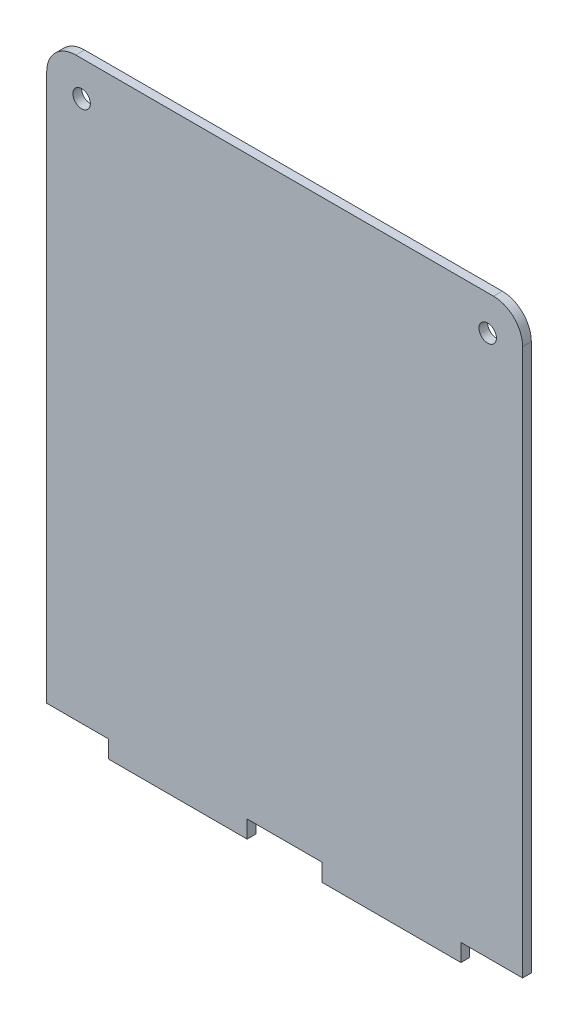
ISO-10303-21;
HEADER;
FILE_DESCRIPTION(('STEP AP214'),'2;1');
FILE_NAME('part.step','',(''),(''),'','','');
FILE_SCHEMA(('AUTOMOTIVE_DESIGN { 1 0 10303 214 1 1 1 1 }'));
ENDSEC;
DATA;
#1=APPLICATION_CONTEXT('core data for automotive mechanical design processes');
#2=APPLICATION_PROTOCOL_DEFINITION('international standard','automotive_design',2000,#1);
#3=PRODUCT_CONTEXT('',#1,'mechanical');
#4=PRODUCT('Part','Part','',(#3));
#5=PRODUCT_RELATED_PRODUCT_CATEGORY('part','',(#4));
#6=PRODUCT_DEFINITION_FORMATION('','',#4);
#7=PRODUCT_DEFINITION_CONTEXT('part definition',#1,'design');
#8=PRODUCT_DEFINITION('design','',#6,#7);
#9=PRODUCT_DEFINITION_SHAPE('','',#8);
#10=(LENGTH_UNIT() NAMED_UNIT(*) SI_UNIT(.MILLI.,.METRE.));
#11=(NAMED_UNIT(*) PLANE_ANGLE_UNIT() SI_UNIT($,.RADIAN.));
#12=(NAMED_UNIT(*) SI_UNIT($,.STERADIAN.) SOLID_ANGLE_UNIT());
#13=UNCERTAINTY_MEASURE_WITH_UNIT(LENGTH_MEASURE(1.E-05),#10,'distance_accuracy_value','');
#14=(GEOMETRIC_REPRESENTATION_CONTEXT(3) GLOBAL_UNCERTAINTY_ASSIGNED_CONTEXT((#13)) GLOBAL_UNIT_ASSIGNED_CONTEXT((#10,
#11,#12)) REPRESENTATION_CONTEXT('',''));
#15=CARTESIAN_POINT('',(0.,0.,0.));
#16=DIRECTION('',(0.,0.,1.));
#17=DIRECTION('',(1.,0.,0.));
#18=AXIS2_PLACEMENT_3D('',#15,#16,#17);
#19=CARTESIAN_POINT('',(0.,0.,1.5));
#20=DIRECTION('',(0.,0.,-1.));
#21=DIRECTION('',(-1.,0.,0.));
#22=AXIS2_PLACEMENT_3D('',#19,#20,#21);
#23=PLANE('',#22);
#24=CARTESIAN_POINT('',(75.8,96.,1.5));
#25=DIRECTION('',(0.,0.,-1.));
#26=DIRECTION('',(-1.,0.,0.));
#27=AXIS2_PLACEMENT_3D('',#24,#25,#26);
#28=CIRCLE('',#27,1.5);
#29=CARTESIAN_POINT('',(74.3,96.,1.5));
#30=VERTEX_POINT('',#29);
#31=EDGE_CURVE('E332',#30,#30,#28,.T.);
#32=ORIENTED_EDGE('',*,*,#31,.T.);
#33=EDGE_LOOP('',(#32));
#34=FACE_BOUND('',#33,.T.);
#35=CARTESIAN_POINT('',(6.,96.,1.5));
#36=DIRECTION('',(0.,0.,1.));
#37=DIRECTION('',(1.,0.,0.));
#38=AXIS2_PLACEMENT_3D('',#35,#36,#37);
#39=CIRCLE('',#38,1.5);
#40=CARTESIAN_POINT('',(7.5,96.,1.5));
#41=VERTEX_POINT('',#40);
#42=EDGE_CURVE('E159',#41,#41,#39,.T.);
#43=ORIENTED_EDGE('',*,*,#42,.F.);
#44=EDGE_LOOP('',(#43));
#45=FACE_BOUND('',#44,.T.);
#46=DIRECTION('',(0.,1.,0.));
#47=VECTOR('',#46,1.);
#48=CARTESIAN_POINT('',(81.8,0.,1.5));
#49=LINE('',#48,#47);
#50=CARTESIAN_POINT('',(81.8,3.,1.5));
#51=VERTEX_POINT('',#50);
#52=CARTESIAN_POINT('',(81.8,97.,1.5));
#53=VERTEX_POINT('',#52);
#54=EDGE_CURVE('E169',#51,#53,#49,.T.);
#55=ORIENTED_EDGE('',*,*,#54,.T.);
#56=CARTESIAN_POINT('',(76.8,97.,1.5));
#57=DIRECTION('',(0.,0.,-1.));
#58=DIRECTION('',(-1.,0.,0.));
#59=AXIS2_PLACEMENT_3D('',#56,#57,#58);
#60=CIRCLE('',#59,5.);
#61=CARTESIAN_POINT('',(76.8,102.,1.5));
#62=VERTEX_POINT('',#61);
#63=EDGE_CURVE('E43',#53,#62,#60,.F.);
#64=ORIENTED_EDGE('',*,*,#63,.T.);
#65=DIRECTION('',(-1.,0.,0.));
#66=VECTOR('',#65,1.);
#67=CARTESIAN_POINT('',(0.,102.,1.5));
#68=LINE('',#67,#66);
#69=CARTESIAN_POINT('',(5.,102.,1.5));
#70=VERTEX_POINT('',#69);
#71=EDGE_CURVE('E175',#62,#70,#68,.T.);
#72=ORIENTED_EDGE('',*,*,#71,.T.);
#73=CARTESIAN_POINT('',(5.,97.,1.5));
#74=DIRECTION('',(0.,0.,-1.));
#75=DIRECTION('',(-1.,0.,0.));
#76=AXIS2_PLACEMENT_3D('',#73,#74,#75);
#77=CIRCLE('',#76,5.);
#78=CARTESIAN_POINT('',(0.,97.,1.5));
#79=VERTEX_POINT('',#78);
#80=EDGE_CURVE('E50',#70,#79,#77,.F.);
#81=ORIENTED_EDGE('',*,*,#80,.T.);
#82=DIRECTION('',(0.,-1.,0.));
#83=VECTOR('',#82,1.);
#84=CARTESIAN_POINT('',(0.,0.,1.5));
#85=LINE('',#84,#83);
#86=CARTESIAN_POINT('',(0.,3.,1.5));
#87=VERTEX_POINT('',#86);
#88=EDGE_CURVE('E166',#79,#87,#85,.T.);
#89=ORIENTED_EDGE('',*,*,#88,.T.);
#90=DIRECTION('',(1.,0.,0.));
#91=VECTOR('',#90,1.);
#92=CARTESIAN_POINT('',(0.,3.,1.5));
#93=LINE('',#92,#91);
#94=CARTESIAN_POINT('',(10.6,3.,1.5));
#95=VERTEX_POINT('',#94);
#96=EDGE_CURVE('E251',#87,#95,#93,.T.);
#97=ORIENTED_EDGE('',*,*,#96,.T.);
#98=DIRECTION('',(0.,1.,0.));
#99=VECTOR('',#98,1.);
#100=CARTESIAN_POINT('',(10.6,0.,1.5));
#101=LINE('',#100,#99);
#102=CARTESIAN_POINT('',(10.6,0.,1.5));
#103=VERTEX_POINT('',#102);
#104=EDGE_CURVE('E241',#103,#95,#101,.T.);
#105=ORIENTED_EDGE('',*,*,#104,.F.);
#106=DIRECTION('',(1.,0.,0.));
#107=VECTOR('',#106,1.);
#108=CARTESIAN_POINT('',(0.,0.,1.5));
#109=LINE('',#108,#107);
#110=CARTESIAN_POINT('',(34.455,0.,1.5));
#111=VERTEX_POINT('',#110);
#112=EDGE_CURVE('E165',#103,#111,#109,.T.);
#113=ORIENTED_EDGE('',*,*,#112,.T.);
#114=DIRECTION('',(0.,1.,0.));
#115=VECTOR('',#114,1.);
#116=CARTESIAN_POINT('',(34.455,0.,1.5));
#117=LINE('',#116,#115);
#118=CARTESIAN_POINT('',(34.455,3.,1.5));
#119=VERTEX_POINT('',#118);
#120=EDGE_CURVE('E234',#111,#119,#117,.T.);
#121=ORIENTED_EDGE('',*,*,#120,.T.);
#122=DIRECTION('',(1.,0.,0.));
#123=VECTOR('',#122,1.);
#124=CARTESIAN_POINT('',(0.,3.,1.5));
#125=LINE('',#124,#123);
#126=CARTESIAN_POINT('',(47.345,3.,1.5));
#127=VERTEX_POINT('',#126);
#128=EDGE_CURVE('E237',#119,#127,#125,.T.);
#129=ORIENTED_EDGE('',*,*,#128,.T.);
#130=DIRECTION('',(0.,1.,0.));
#131=VECTOR('',#130,1.);
#132=CARTESIAN_POINT('',(47.345,0.,1.5));
#133=LINE('',#132,#131);
#134=CARTESIAN_POINT('',(47.345,0.,1.5));
#135=VERTEX_POINT('',#134);
#136=EDGE_CURVE('E164',#135,#127,#133,.T.);
#137=ORIENTED_EDGE('',*,*,#136,.F.);
#138=CARTESIAN_POINT('',(71.2,0.,1.5));
#139=VERTEX_POINT('',#138);
#140=EDGE_CURVE('E156',#135,#139,#109,.T.);
#141=ORIENTED_EDGE('',*,*,#140,.T.);
#142=DIRECTION('',(0.,1.,0.));
#143=VECTOR('',#142,1.);
#144=CARTESIAN_POINT('',(71.2,0.,1.5));
#145=LINE('',#144,#143);
#146=CARTESIAN_POINT('',(71.2,3.,1.5));
#147=VERTEX_POINT('',#146);
#148=EDGE_CURVE('E138',#139,#147,#145,.T.);
#149=ORIENTED_EDGE('',*,*,#148,.T.);
#150=DIRECTION('',(-1.,0.,0.));
#151=VECTOR('',#150,1.);
#152=CARTESIAN_POINT('',(0.,3.,1.5));
#153=LINE('',#152,#151);
#154=EDGE_CURVE('E148',#51,#147,#153,.T.);
#155=ORIENTED_EDGE('',*,*,#154,.F.);
#156=EDGE_LOOP('',(#55,#64,#72,#81,#89,#97,#105,#113,#121,#129,#137,#141,#149,#155));
#157=FACE_BOUND('',#156,.T.);
#158=ADVANCED_FACE('F35',(#34,#45,#157),#23,.F.);
#159=CARTESIAN_POINT('',(0.,0.,0.));
#160=DIRECTION('',(0.,0.,-1.));
#161=DIRECTION('',(-1.,0.,0.));
#162=AXIS2_PLACEMENT_3D('',#159,#160,#161);
#163=PLANE('',#162);
#164=CARTESIAN_POINT('',(75.8,96.,0.));
#165=DIRECTION('',(0.,0.,-1.));
#166=DIRECTION('',(-1.,0.,0.));
#167=AXIS2_PLACEMENT_3D('',#164,#165,#166);
#168=CIRCLE('',#167,1.5);
#169=CARTESIAN_POINT('',(74.3,96.,0.));
#170=VERTEX_POINT('',#169);
#171=EDGE_CURVE('E330',#170,#170,#168,.T.);
#172=ORIENTED_EDGE('',*,*,#171,.F.);
#173=EDGE_LOOP('',(#172));
#174=FACE_BOUND('',#173,.T.);
#175=CARTESIAN_POINT('',(6.,96.,0.));
#176=DIRECTION('',(0.,0.,1.));
#177=DIRECTION('',(1.,0.,0.));
#178=AXIS2_PLACEMENT_3D('',#175,#176,#177);
#179=CIRCLE('',#178,1.5);
#180=CARTESIAN_POINT('',(7.5,96.,0.));
#181=VERTEX_POINT('',#180);
#182=EDGE_CURVE('E219',#181,#181,#179,.T.);
#183=ORIENTED_EDGE('',*,*,#182,.T.);
#184=EDGE_LOOP('',(#183));
#185=FACE_BOUND('',#184,.T.);
#186=DIRECTION('',(-1.,0.,0.));
#187=VECTOR('',#186,1.);
#188=CARTESIAN_POINT('',(0.,102.,0.));
#189=LINE('',#188,#187);
#190=CARTESIAN_POINT('',(76.8,102.,0.));
#191=VERTEX_POINT('',#190);
#192=CARTESIAN_POINT('',(5.,102.,0.));
#193=VERTEX_POINT('',#192);
#194=EDGE_CURVE('E170',#191,#193,#189,.T.);
#195=ORIENTED_EDGE('',*,*,#194,.F.);
#196=CARTESIAN_POINT('',(76.8,97.,0.));
#197=DIRECTION('',(0.,0.,-1.));
#198=DIRECTION('',(-1.,0.,0.));
#199=AXIS2_PLACEMENT_3D('',#196,#197,#198);
#200=CIRCLE('',#199,5.);
#201=CARTESIAN_POINT('',(81.8,97.,0.));
#202=VERTEX_POINT('',#201);
#203=EDGE_CURVE('E194',#191,#202,#200,.T.);
#204=ORIENTED_EDGE('',*,*,#203,.T.);
#205=DIRECTION('',(0.,1.,0.));
#206=VECTOR('',#205,1.);
#207=CARTESIAN_POINT('',(81.8,0.,0.));
#208=LINE('',#207,#206);
#209=CARTESIAN_POINT('',(81.8,3.,0.));
#210=VERTEX_POINT('',#209);
#211=EDGE_CURVE('E184',#210,#202,#208,.T.);
#212=ORIENTED_EDGE('',*,*,#211,.F.);
#213=DIRECTION('',(-1.,0.,0.));
#214=VECTOR('',#213,1.);
#215=CARTESIAN_POINT('',(0.,3.,0.));
#216=LINE('',#215,#214);
#217=CARTESIAN_POINT('',(71.2,3.,0.));
#218=VERTEX_POINT('',#217);
#219=EDGE_CURVE('E149',#210,#218,#216,.T.);
#220=ORIENTED_EDGE('',*,*,#219,.T.);
#221=DIRECTION('',(0.,1.,0.));
#222=VECTOR('',#221,1.);
#223=CARTESIAN_POINT('',(71.2,0.,0.));
#224=LINE('',#223,#222);
#225=CARTESIAN_POINT('',(71.2,0.,0.));
#226=VERTEX_POINT('',#225);
#227=EDGE_CURVE('E214',#226,#218,#224,.T.);
#228=ORIENTED_EDGE('',*,*,#227,.F.);
#229=DIRECTION('',(1.,0.,0.));
#230=VECTOR('',#229,1.);
#231=CARTESIAN_POINT('',(0.,0.,0.));
#232=LINE('',#231,#230);
#233=CARTESIAN_POINT('',(47.345,0.,0.));
#234=VERTEX_POINT('',#233);
#235=EDGE_CURVE('E158',#234,#226,#232,.T.);
#236=ORIENTED_EDGE('',*,*,#235,.F.);
#237=DIRECTION('',(0.,1.,0.));
#238=VECTOR('',#237,1.);
#239=CARTESIAN_POINT('',(47.345,0.,0.));
#240=LINE('',#239,#238);
#241=CARTESIAN_POINT('',(47.345,3.,0.));
#242=VERTEX_POINT('',#241);
#243=EDGE_CURVE('E238',#234,#242,#240,.T.);
#244=ORIENTED_EDGE('',*,*,#243,.T.);
#245=DIRECTION('',(1.,0.,0.));
#246=VECTOR('',#245,1.);
#247=CARTESIAN_POINT('',(0.,3.,0.));
#248=LINE('',#247,#246);
#249=CARTESIAN_POINT('',(34.455,3.,0.));
#250=VERTEX_POINT('',#249);
#251=EDGE_CURVE('E243',#250,#242,#248,.T.);
#252=ORIENTED_EDGE('',*,*,#251,.F.);
#253=DIRECTION('',(0.,1.,0.));
#254=VECTOR('',#253,1.);
#255=CARTESIAN_POINT('',(34.455,0.,0.));
#256=LINE('',#255,#254);
#257=CARTESIAN_POINT('',(34.455,0.,0.));
#258=VERTEX_POINT('',#257);
#259=EDGE_CURVE('E227',#258,#250,#256,.T.);
#260=ORIENTED_EDGE('',*,*,#259,.F.);
#261=CARTESIAN_POINT('',(10.6,0.,0.));
#262=VERTEX_POINT('',#261);
#263=EDGE_CURVE('E181',#262,#258,#232,.T.);
#264=ORIENTED_EDGE('',*,*,#263,.F.);
#265=DIRECTION('',(0.,1.,0.));
#266=VECTOR('',#265,1.);
#267=CARTESIAN_POINT('',(10.6,0.,0.));
#268=LINE('',#267,#266);
#269=CARTESIAN_POINT('',(10.6,3.,0.));
#270=VERTEX_POINT('',#269);
#271=EDGE_CURVE('E247',#262,#270,#268,.T.);
#272=ORIENTED_EDGE('',*,*,#271,.T.);
#273=DIRECTION('',(1.,0.,0.));
#274=VECTOR('',#273,1.);
#275=CARTESIAN_POINT('',(0.,3.,0.));
#276=LINE('',#275,#274);
#277=CARTESIAN_POINT('',(0.,3.,0.));
#278=VERTEX_POINT('',#277);
#279=EDGE_CURVE('E250',#278,#270,#276,.T.);
#280=ORIENTED_EDGE('',*,*,#279,.F.);
#281=DIRECTION('',(0.,-1.,0.));
#282=VECTOR('',#281,1.);
#283=CARTESIAN_POINT('',(0.,0.,0.));
#284=LINE('',#283,#282);
#285=CARTESIAN_POINT('',(0.,97.,0.));
#286=VERTEX_POINT('',#285);
#287=EDGE_CURVE('E178',#286,#278,#284,.T.);
#288=ORIENTED_EDGE('',*,*,#287,.F.);
#289=CARTESIAN_POINT('',(5.,97.,0.));
#290=DIRECTION('',(0.,0.,-1.));
#291=DIRECTION('',(-1.,0.,0.));
#292=AXIS2_PLACEMENT_3D('',#289,#290,#291);
#293=CIRCLE('',#292,5.);
#294=EDGE_CURVE('E192',#286,#193,#293,.T.);
#295=ORIENTED_EDGE('',*,*,#294,.T.);
#296=EDGE_LOOP('',(#195,#204,#212,#220,#228,#236,#244,#252,#260,#264,#272,#280,#288,#295));
#297=FACE_BOUND('',#296,.T.);
#298=ADVANCED_FACE('F208',(#174,#185,#297),#163,.T.);
#299=CARTESIAN_POINT('',(0.,0.,1.5));
#300=DIRECTION('',(0.,1.,0.));
#301=DIRECTION('',(0.,0.,1.));
#302=AXIS2_PLACEMENT_3D('',#299,#300,#301);
#303=PLANE('',#302);
#304=DIRECTION('',(0.,0.,1.));
#305=VECTOR('',#304,1.);
#306=CARTESIAN_POINT('',(71.2,0.,0.));
#307=LINE('',#306,#305);
#308=EDGE_CURVE('E141',#226,#139,#307,.T.);
#309=ORIENTED_EDGE('',*,*,#308,.T.);
#310=ORIENTED_EDGE('',*,*,#140,.F.);
#311=DIRECTION('',(0.,0.,1.));
#312=VECTOR('',#311,1.);
#313=CARTESIAN_POINT('',(47.345,0.,0.));
#314=LINE('',#313,#312);
#315=EDGE_CURVE('E225',#234,#135,#314,.T.);
#316=ORIENTED_EDGE('',*,*,#315,.F.);
#317=ORIENTED_EDGE('',*,*,#235,.T.);
#318=EDGE_LOOP('',(#309,#310,#316,#317));
#319=FACE_BOUND('',#318,.T.);
#320=ADVANCED_FACE('F154',(#319),#303,.F.);
#321=DIRECTION('',(0.,0.,1.));
#322=VECTOR('',#321,1.);
#323=CARTESIAN_POINT('',(34.455,0.,0.));
#324=LINE('',#323,#322);
#325=EDGE_CURVE('E222',#258,#111,#324,.T.);
#326=ORIENTED_EDGE('',*,*,#325,.T.);
#327=ORIENTED_EDGE('',*,*,#112,.F.);
#328=DIRECTION('',(0.,0.,1.));
#329=VECTOR('',#328,1.);
#330=CARTESIAN_POINT('',(10.6,0.,0.));
#331=LINE('',#330,#329);
#332=EDGE_CURVE('E254',#262,#103,#331,.T.);
#333=ORIENTED_EDGE('',*,*,#332,.F.);
#334=ORIENTED_EDGE('',*,*,#263,.T.);
#335=EDGE_LOOP('',(#326,#327,#333,#334));
#336=FACE_BOUND('',#335,.T.);
#337=ADVANCED_FACE('F270',(#336),#303,.F.);
#338=CARTESIAN_POINT('',(0.,0.,1.5));
#339=DIRECTION('',(1.,0.,0.));
#340=DIRECTION('',(0.,0.,-1.));
#341=AXIS2_PLACEMENT_3D('',#338,#339,#340);
#342=PLANE('',#341);
#343=ORIENTED_EDGE('',*,*,#88,.F.);
#344=DIRECTION('',(0.,0.,-1.));
#345=VECTOR('',#344,1.);
#346=CARTESIAN_POINT('',(0.,97.,1.5));
#347=LINE('',#346,#345);
#348=EDGE_CURVE('E11',#79,#286,#347,.T.);
#349=ORIENTED_EDGE('',*,*,#348,.T.);
#350=ORIENTED_EDGE('',*,*,#287,.T.);
#351=DIRECTION('',(0.,0.,1.));
#352=VECTOR('',#351,1.);
#353=CARTESIAN_POINT('',(0.,3.,0.));
#354=LINE('',#353,#352);
#355=EDGE_CURVE('E180',#278,#87,#354,.T.);
#356=ORIENTED_EDGE('',*,*,#355,.T.);
#357=EDGE_LOOP('',(#343,#349,#350,#356));
#358=FACE_BOUND('',#357,.T.);
#359=ADVANCED_FACE('F312',(#358),#342,.F.);
#360=CARTESIAN_POINT('',(81.8,0.,1.5));
#361=DIRECTION('',(-1.,0.,0.));
#362=DIRECTION('',(0.,0.,1.));
#363=AXIS2_PLACEMENT_3D('',#360,#361,#362);
#364=PLANE('',#363);
#365=ORIENTED_EDGE('',*,*,#211,.T.);
#366=DIRECTION('',(0.,0.,-1.));
#367=VECTOR('',#366,1.);
#368=CARTESIAN_POINT('',(81.8,97.,1.5));
#369=LINE('',#368,#367);
#370=EDGE_CURVE('E58',#202,#53,#369,.F.);
#371=ORIENTED_EDGE('',*,*,#370,.T.);
#372=ORIENTED_EDGE('',*,*,#54,.F.);
#373=DIRECTION('',(0.,0.,1.));
#374=VECTOR('',#373,1.);
#375=CARTESIAN_POINT('',(81.8,3.,0.));
#376=LINE('',#375,#374);
#377=EDGE_CURVE('E212',#210,#51,#376,.T.);
#378=ORIENTED_EDGE('',*,*,#377,.F.);
#379=EDGE_LOOP('',(#365,#371,#372,#378));
#380=FACE_BOUND('',#379,.T.);
#381=ADVANCED_FACE('F211',(#380),#364,.F.);
#382=CARTESIAN_POINT('',(0.,102.,1.5));
#383=DIRECTION('',(0.,-1.,0.));
#384=DIRECTION('',(0.,0.,-1.));
#385=AXIS2_PLACEMENT_3D('',#382,#383,#384);
#386=PLANE('',#385);
#387=ORIENTED_EDGE('',*,*,#71,.F.);
#388=DIRECTION('',(0.,0.,-1.));
#389=VECTOR('',#388,1.);
#390=CARTESIAN_POINT('',(76.8,102.,1.5));
#391=LINE('',#390,#389);
#392=EDGE_CURVE('E189',#62,#191,#391,.T.);
#393=ORIENTED_EDGE('',*,*,#392,.T.);
#394=ORIENTED_EDGE('',*,*,#194,.T.);
#395=DIRECTION('',(0.,0.,-1.));
#396=VECTOR('',#395,1.);
#397=CARTESIAN_POINT('',(5.,102.,1.5));
#398=LINE('',#397,#396);
#399=EDGE_CURVE('E177',#193,#70,#398,.F.);
#400=ORIENTED_EDGE('',*,*,#399,.T.);
#401=EDGE_LOOP('',(#387,#393,#394,#400));
#402=FACE_BOUND('',#401,.T.);
#403=ADVANCED_FACE('F202',(#402),#386,.F.);
#404=CARTESIAN_POINT('',(0.,3.,0.));
#405=DIRECTION('',(0.,-1.,0.));
#406=DIRECTION('',(0.,0.,-1.));
#407=AXIS2_PLACEMENT_3D('',#404,#405,#406);
#408=PLANE('',#407);
#409=ORIENTED_EDGE('',*,*,#96,.F.);
#410=ORIENTED_EDGE('',*,*,#355,.F.);
#411=ORIENTED_EDGE('',*,*,#279,.T.);
#412=DIRECTION('',(0.,0.,1.));
#413=VECTOR('',#412,1.);
#414=CARTESIAN_POINT('',(10.6,3.,0.));
#415=LINE('',#414,#413);
#416=EDGE_CURVE('E261',#270,#95,#415,.T.);
#417=ORIENTED_EDGE('',*,*,#416,.T.);
#418=EDGE_LOOP('',(#409,#410,#411,#417));
#419=FACE_BOUND('',#418,.T.);
#420=ADVANCED_FACE('F309',(#419),#408,.T.);
#421=CARTESIAN_POINT('',(10.6,0.,0.));
#422=DIRECTION('',(1.,0.,0.));
#423=DIRECTION('',(0.,0.,-1.));
#424=AXIS2_PLACEMENT_3D('',#421,#422,#423);
#425=PLANE('',#424);
#426=ORIENTED_EDGE('',*,*,#104,.T.);
#427=ORIENTED_EDGE('',*,*,#416,.F.);
#428=ORIENTED_EDGE('',*,*,#271,.F.);
#429=ORIENTED_EDGE('',*,*,#332,.T.);
#430=EDGE_LOOP('',(#426,#427,#428,#429));
#431=FACE_BOUND('',#430,.T.);
#432=ADVANCED_FACE('F265',(#431),#425,.F.);
#433=CARTESIAN_POINT('',(34.455,0.,0.));
#434=DIRECTION('',(1.,0.,0.));
#435=DIRECTION('',(0.,0.,-1.));
#436=AXIS2_PLACEMENT_3D('',#433,#434,#435);
#437=PLANE('',#436);
#438=ORIENTED_EDGE('',*,*,#120,.F.);
#439=ORIENTED_EDGE('',*,*,#325,.F.);
#440=ORIENTED_EDGE('',*,*,#259,.T.);
#441=DIRECTION('',(0.,0.,1.));
#442=VECTOR('',#441,1.);
#443=CARTESIAN_POINT('',(34.455,3.,0.));
#444=LINE('',#443,#442);
#445=EDGE_CURVE('E230',#250,#119,#444,.T.);
#446=ORIENTED_EDGE('',*,*,#445,.T.);
#447=EDGE_LOOP('',(#438,#439,#440,#446));
#448=FACE_BOUND('',#447,.T.);
#449=ADVANCED_FACE('F273',(#448),#437,.T.);
#450=CARTESIAN_POINT('',(0.,3.,0.));
#451=DIRECTION('',(0.,-1.,0.));
#452=DIRECTION('',(0.,0.,-1.));
#453=AXIS2_PLACEMENT_3D('',#450,#451,#452);
#454=PLANE('',#453);
#455=ORIENTED_EDGE('',*,*,#128,.F.);
#456=ORIENTED_EDGE('',*,*,#445,.F.);
#457=ORIENTED_EDGE('',*,*,#251,.T.);
#458=DIRECTION('',(0.,0.,1.));
#459=VECTOR('',#458,1.);
#460=CARTESIAN_POINT('',(47.345,3.,0.));
#461=LINE('',#460,#459);
#462=EDGE_CURVE('E228',#242,#127,#461,.T.);
#463=ORIENTED_EDGE('',*,*,#462,.T.);
#464=EDGE_LOOP('',(#455,#456,#457,#463));
#465=FACE_BOUND('',#464,.T.);
#466=ADVANCED_FACE('F279',(#465),#454,.T.);
#467=CARTESIAN_POINT('',(47.345,0.,0.));
#468=DIRECTION('',(1.,0.,0.));
#469=DIRECTION('',(0.,0.,-1.));
#470=AXIS2_PLACEMENT_3D('',#467,#468,#469);
#471=PLANE('',#470);
#472=ORIENTED_EDGE('',*,*,#136,.T.);
#473=ORIENTED_EDGE('',*,*,#462,.F.);
#474=ORIENTED_EDGE('',*,*,#243,.F.);
#475=ORIENTED_EDGE('',*,*,#315,.T.);
#476=EDGE_LOOP('',(#472,#473,#474,#475));
#477=FACE_BOUND('',#476,.T.);
#478=ADVANCED_FACE('F281',(#477),#471,.F.);
#479=CARTESIAN_POINT('',(71.2,0.,0.));
#480=DIRECTION('',(1.,0.,0.));
#481=DIRECTION('',(0.,0.,-1.));
#482=AXIS2_PLACEMENT_3D('',#479,#480,#481);
#483=PLANE('',#482);
#484=ORIENTED_EDGE('',*,*,#148,.F.);
#485=ORIENTED_EDGE('',*,*,#308,.F.);
#486=ORIENTED_EDGE('',*,*,#227,.T.);
#487=DIRECTION('',(0.,0.,1.));
#488=VECTOR('',#487,1.);
#489=CARTESIAN_POINT('',(71.2,3.,0.));
#490=LINE('',#489,#488);
#491=EDGE_CURVE('E144',#218,#147,#490,.T.);
#492=ORIENTED_EDGE('',*,*,#491,.T.);
#493=EDGE_LOOP('',(#484,#485,#486,#492));
#494=FACE_BOUND('',#493,.T.);
#495=ADVANCED_FACE('F140',(#494),#483,.T.);
#496=CARTESIAN_POINT('',(0.,3.,0.));
#497=DIRECTION('',(0.,1.,0.));
#498=DIRECTION('',(0.,0.,1.));
#499=AXIS2_PLACEMENT_3D('',#496,#497,#498);
#500=PLANE('',#499);
#501=ORIENTED_EDGE('',*,*,#154,.T.);
#502=ORIENTED_EDGE('',*,*,#491,.F.);
#503=ORIENTED_EDGE('',*,*,#219,.F.);
#504=ORIENTED_EDGE('',*,*,#377,.T.);
#505=EDGE_LOOP('',(#501,#502,#503,#504));
#506=FACE_BOUND('',#505,.T.);
#507=ADVANCED_FACE('F282',(#506),#500,.F.);
#508=CARTESIAN_POINT('',(6.,96.,0.));
#509=DIRECTION('',(0.,0.,1.));
#510=DIRECTION('',(1.,0.,0.));
#511=AXIS2_PLACEMENT_3D('',#508,#509,#510);
#512=CYLINDRICAL_SURFACE('',#511,1.5);
#513=ORIENTED_EDGE('',*,*,#182,.F.);
#514=EDGE_LOOP('',(#513));
#515=FACE_BOUND('',#514,.T.);
#516=ORIENTED_EDGE('',*,*,#42,.T.);
#517=EDGE_LOOP('',(#516));
#518=FACE_BOUND('',#517,.T.);
#519=ADVANCED_FACE('F284',(#515,#518),#512,.F.);
#520=CARTESIAN_POINT('',(75.8,96.,0.));
#521=DIRECTION('',(0.,0.,1.));
#522=DIRECTION('',(1.,0.,0.));
#523=AXIS2_PLACEMENT_3D('',#520,#521,#522);
#524=CYLINDRICAL_SURFACE('',#523,1.5);
#525=ORIENTED_EDGE('',*,*,#171,.T.);
#526=EDGE_LOOP('',(#525));
#527=FACE_BOUND('',#526,.T.);
#528=ORIENTED_EDGE('',*,*,#31,.F.);
#529=EDGE_LOOP('',(#528));
#530=FACE_BOUND('',#529,.T.);
#531=ADVANCED_FACE('F290',(#527,#530),#524,.F.);
#532=CARTESIAN_POINT('',(76.8,97.,1.5));
#533=DIRECTION('',(0.,0.,-1.));
#534=DIRECTION('',(-1.,0.,0.));
#535=AXIS2_PLACEMENT_3D('',#532,#533,#534);
#536=CYLINDRICAL_SURFACE('',#535,5.);
#537=ORIENTED_EDGE('',*,*,#63,.F.);
#538=ORIENTED_EDGE('',*,*,#370,.F.);
#539=ORIENTED_EDGE('',*,*,#203,.F.);
#540=ORIENTED_EDGE('',*,*,#392,.F.);
#541=EDGE_LOOP('',(#537,#538,#539,#540));
#542=FACE_BOUND('',#541,.T.);
#543=ADVANCED_FACE('F205',(#542),#536,.T.);
#544=CARTESIAN_POINT('',(5.,97.,1.5));
#545=DIRECTION('',(0.,0.,-1.));
#546=DIRECTION('',(-1.,0.,0.));
#547=AXIS2_PLACEMENT_3D('',#544,#545,#546);
#548=CYLINDRICAL_SURFACE('',#547,5.);
#549=ORIENTED_EDGE('',*,*,#80,.F.);
#550=ORIENTED_EDGE('',*,*,#399,.F.);
#551=ORIENTED_EDGE('',*,*,#294,.F.);
#552=ORIENTED_EDGE('',*,*,#348,.F.);
#553=EDGE_LOOP('',(#549,#550,#551,#552));
#554=FACE_BOUND('',#553,.T.);
#555=ADVANCED_FACE('F37',(#554),#548,.T.);
#556=CLOSED_SHELL('',(#158,#298,#320,#337,#359,#381,#403,#420,#432,#449,#466,#478,#495,#507,
#519,#531,#543,#555));
#557=MANIFOLD_SOLID_BREP('B2',#556);
#558=ADVANCED_BREP_SHAPE_REPRESENTATION('',(#18,#557),#14);
#559=SHAPE_DEFINITION_REPRESENTATION(#9,#558);
ENDSEC;
END-ISO-10303-21;
